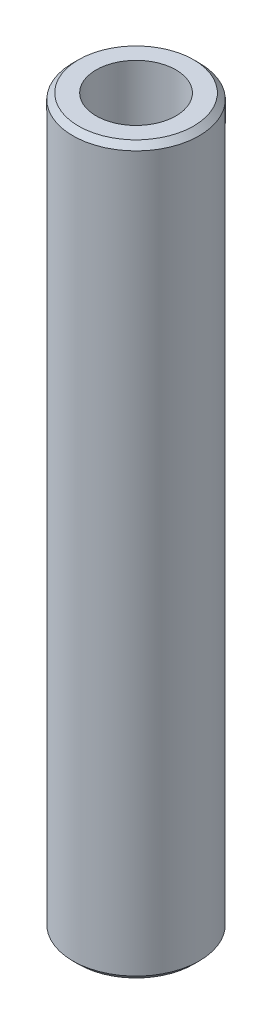
ISO-10303-21;
HEADER;
FILE_DESCRIPTION(('STEP AP214'),'2;1');
FILE_NAME('part.step','',(''),(''),'','','');
FILE_SCHEMA(('AUTOMOTIVE_DESIGN { 1 0 10303 214 1 1 1 1 }'));
ENDSEC;
DATA;
#1=APPLICATION_CONTEXT('core data for automotive mechanical design processes');
#2=APPLICATION_PROTOCOL_DEFINITION('international standard','automotive_design',2000,#1);
#3=PRODUCT_CONTEXT('',#1,'mechanical');
#4=PRODUCT('Part','Part','',(#3));
#5=PRODUCT_RELATED_PRODUCT_CATEGORY('part','',(#4));
#6=PRODUCT_DEFINITION_FORMATION('','',#4);
#7=PRODUCT_DEFINITION_CONTEXT('part definition',#1,'design');
#8=PRODUCT_DEFINITION('design','',#6,#7);
#9=PRODUCT_DEFINITION_SHAPE('','',#8);
#10=(LENGTH_UNIT() NAMED_UNIT(*) SI_UNIT(.MILLI.,.METRE.));
#11=(NAMED_UNIT(*) PLANE_ANGLE_UNIT() SI_UNIT($,.RADIAN.));
#12=(NAMED_UNIT(*) SI_UNIT($,.STERADIAN.) SOLID_ANGLE_UNIT());
#13=UNCERTAINTY_MEASURE_WITH_UNIT(LENGTH_MEASURE(1.E-05),#10,'distance_accuracy_value','');
#14=(GEOMETRIC_REPRESENTATION_CONTEXT(3) GLOBAL_UNCERTAINTY_ASSIGNED_CONTEXT((#13)) GLOBAL_UNIT_ASSIGNED_CONTEXT((#10,
#11,#12)) REPRESENTATION_CONTEXT('',''));
#15=CARTESIAN_POINT('',(0.,0.,0.));
#16=DIRECTION('',(0.,0.,1.));
#17=DIRECTION('',(1.,0.,0.));
#18=AXIS2_PLACEMENT_3D('',#15,#16,#17);
#19=CARTESIAN_POINT('',(0.,114.949775311251,0.));
#20=DIRECTION('',(0.,-1.,0.));
#21=DIRECTION('',(0.,0.,-1.));
#22=AXIS2_PLACEMENT_3D('',#19,#20,#21);
#23=CYLINDRICAL_SURFACE('',#22,10.);
#24=CARTESIAN_POINT('',(0.,114.060758058359,0.));
#25=DIRECTION('',(0.,1.,0.));
#26=DIRECTION('',(0.,0.,1.));
#27=AXIS2_PLACEMENT_3D('',#24,#25,#26);
#28=CIRCLE('',#27,10.);
#29=CARTESIAN_POINT('',(0.,114.060758058359,-10.));
#30=VERTEX_POINT('',#29);
#31=EDGE_CURVE('E50',#30,#30,#28,.F.);
#32=CARTESIAN_POINT('',(0.,0.889017252891852,0.));
#33=DIRECTION('',(0.,1.,0.));
#34=DIRECTION('',(0.,0.,1.));
#35=AXIS2_PLACEMENT_3D('',#32,#33,#34);
#36=CIRCLE('',#35,10.);
#37=CARTESIAN_POINT('',(0.,0.889017252891852,-10.));
#38=VERTEX_POINT('',#37);
#39=EDGE_CURVE('E51',#38,#38,#36,.T.);
#40=CARTESIAN_POINT('',(0.,114.060758058359,-10.));
#41=CARTESIAN_POINT('',(0.,112.881885758302,-10.));
#42=CARTESIAN_POINT('',(0.,111.703013458245,-10.));
#43=CARTESIAN_POINT('',(0.,109.345268858131,-10.));
#44=CARTESIAN_POINT('',(0.,108.166396558074,-10.));
#45=CARTESIAN_POINT('',(0.,105.808651957961,-10.));
#46=CARTESIAN_POINT('',(0.,104.629779657904,-10.));
#47=CARTESIAN_POINT('',(0.,102.27203505779,-10.));
#48=CARTESIAN_POINT('',(0.,101.093162757733,-10.));
#49=CARTESIAN_POINT('',(0.,98.7354181576189,-10.));
#50=CARTESIAN_POINT('',(0.,97.5565458575619,-10.));
#51=CARTESIAN_POINT('',(0.,95.198801257448,-10.));
#52=CARTESIAN_POINT('',(0.,94.0199289573911,-10.));
#53=CARTESIAN_POINT('',(0.,91.6621843572772,-10.));
#54=CARTESIAN_POINT('',(0.,90.4833120572202,-10.));
#55=CARTESIAN_POINT('',(0.,88.1255674571063,-10.));
#56=CARTESIAN_POINT('',(0.,86.9466951570493,-10.));
#57=CARTESIAN_POINT('',(0.,84.5889505569355,-10.));
#58=CARTESIAN_POINT('',(0.,83.4100782568785,-10.));
#59=CARTESIAN_POINT('',(0.,81.0523336567646,-10.));
#60=CARTESIAN_POINT('',(0.,79.8734613567076,-10.));
#61=CARTESIAN_POINT('',(0.,77.5157167565937,-10.));
#62=CARTESIAN_POINT('',(0.,76.3368444565368,-10.));
#63=CARTESIAN_POINT('',(0.,73.9790998564229,-10.));
#64=CARTESIAN_POINT('',(0.,72.8002275563659,-10.));
#65=CARTESIAN_POINT('',(0.,70.442482956252,-10.));
#66=CARTESIAN_POINT('',(0.,69.2636106561951,-10.));
#67=CARTESIAN_POINT('',(0.,66.9058660560812,-10.));
#68=CARTESIAN_POINT('',(0.,65.7269937560242,-10.));
#69=CARTESIAN_POINT('',(0.,63.3692491559103,-10.));
#70=CARTESIAN_POINT('',(0.,62.1903768558534,-10.));
#71=CARTESIAN_POINT('',(0.,59.8326322557395,-10.));
#72=CARTESIAN_POINT('',(0.,58.6537599556825,-10.));
#73=CARTESIAN_POINT('',(0.,56.2960153555686,-10.));
#74=CARTESIAN_POINT('',(0.,55.1171430555117,-10.));
#75=CARTESIAN_POINT('',(0.,52.7593984553978,-10.));
#76=CARTESIAN_POINT('',(0.,51.5805261553408,-10.));
#77=CARTESIAN_POINT('',(0.,49.2227815552269,-10.));
#78=CARTESIAN_POINT('',(0.,48.04390925517,-10.));
#79=CARTESIAN_POINT('',(0.,45.686164655056,-10.));
#80=CARTESIAN_POINT('',(0.,44.5072923549991,-10.));
#81=CARTESIAN_POINT('',(0.,42.1495477548852,-10.));
#82=CARTESIAN_POINT('',(0.,40.9706754548282,-10.));
#83=CARTESIAN_POINT('',(0.,38.6129308547143,-10.));
#84=CARTESIAN_POINT('',(0.,37.4340585546574,-10.));
#85=CARTESIAN_POINT('',(0.,35.0763139545435,-10.));
#86=CARTESIAN_POINT('',(0.,33.8974416544865,-10.));
#87=CARTESIAN_POINT('',(0.,31.5396970543726,-10.));
#88=CARTESIAN_POINT('',(0.,30.3608247543157,-10.));
#89=CARTESIAN_POINT('',(0.,28.0030801542018,-10.));
#90=CARTESIAN_POINT('',(0.,26.8242078541448,-10.));
#91=CARTESIAN_POINT('',(0.,24.4664632540309,-10.));
#92=CARTESIAN_POINT('',(0.,23.287590953974,-10.));
#93=CARTESIAN_POINT('',(0.,20.92984635386,-10.));
#94=CARTESIAN_POINT('',(0.,19.7509740538031,-10.));
#95=CARTESIAN_POINT('',(0.,17.3932294536892,-10.));
#96=CARTESIAN_POINT('',(0.,16.2143571536322,-10.));
#97=CARTESIAN_POINT('',(0.,13.8566125535183,-10.));
#98=CARTESIAN_POINT('',(0.,12.6777402534614,-10.));
#99=CARTESIAN_POINT('',(0.,10.3199956533475,-10.));
#100=CARTESIAN_POINT('',(0.,9.14112335329052,-10.));
#101=CARTESIAN_POINT('',(0.,6.78337875317662,-10.));
#102=CARTESIAN_POINT('',(0.,5.60450645311968,-10.));
#103=CARTESIAN_POINT('',(0.,3.24676185300577,-10.));
#104=CARTESIAN_POINT('',(0.,2.06788955294881,-10.));
#105=CARTESIAN_POINT('',(0.,0.889017252891852,-10.));
#106=B_SPLINE_CURVE_WITH_KNOTS('',3,(#40,#41,#42,#43,#44,#45,#46,#47,#48,#49,#50,#51,#52,#53,
#54,#55,#56,#57,#58,#59,#60,#61,#62,#63,#64,#65,#66,#67,#68,#69,#70,#71,#72,#73,#74,#75,#76,#77,
#78,#79,#80,#81,#82,#83,#84,#85,#86,#87,#88,#89,#90,#91,#92,#93,#94,#95,#96,#97,#98,#99,#100,
#101,#102,#103,#104,#105),.UNSPECIFIED.,.F.,.F.,(4,2,2,2,2,2,2,2,2,2,2,2,2,2,2,2,2,2,2,2,2,2,2,
2,2,2,2,2,2,2,2,2,4),(0.,3.53661690017086,7.07323380034172,10.6098507005126,14.1464676006834,
17.6830845008543,21.2197014010251,24.756318301196,28.2929352013669,31.8295521015377,
35.3661690017086,38.9027859018794,42.4394028020503,45.9760197022211,49.512636602392,
53.0492535025628,56.5858704027337,60.1224873029046,63.6591042030754,67.1957211032463,
70.7323380034171,74.268954903588,77.8055718037588,81.3421887039297,84.8788056041005,
88.4154225042714,91.9520394044423,95.4886563046131,99.025273204784,102.561890104955,
106.098507005126,109.635123905297,113.171740805467),.UNSPECIFIED.);
#107=EDGE_CURVE('BSEAM39',#30,#38,#106,.T.);
#108=ORIENTED_EDGE('',*,*,#31,.T.);
#109=ORIENTED_EDGE('',*,*,#39,.T.);
#110=ORIENTED_EDGE('',*,*,#107,.T.);
#111=ORIENTED_EDGE('',*,*,#107,.F.);
#112=EDGE_LOOP('',(#108,#110,#109,#111));
#113=FACE_BOUND('',#112,.T.);
#114=ADVANCED_FACE('F39',(#113),#23,.T.);
#115=CARTESIAN_POINT('',(0.,114.949775311251,0.));
#116=DIRECTION('',(0.,1.,0.));
#117=DIRECTION('',(0.,0.,1.));
#118=AXIS2_PLACEMENT_3D('',#115,#116,#117);
#119=PLANE('',#118);
#120=CARTESIAN_POINT('',(0.,114.949775311251,0.));
#121=DIRECTION('',(0.,1.,0.));
#122=DIRECTION('',(0.,0.,1.));
#123=AXIS2_PLACEMENT_3D('',#120,#121,#122);
#124=CIRCLE('',#123,9.11098274710827);
#125=CARTESIAN_POINT('',(0.,114.949775311251,9.11098274710827));
#126=VERTEX_POINT('',#125);
#127=EDGE_CURVE('E54',#126,#126,#124,.T.);
#128=ORIENTED_EDGE('',*,*,#127,.T.);
#129=EDGE_LOOP('',(#128));
#130=FACE_BOUND('',#129,.T.);
#131=CARTESIAN_POINT('',(0.,114.949775311251,0.));
#132=DIRECTION('',(0.,1.,0.));
#133=DIRECTION('',(0.,0.,1.));
#134=AXIS2_PLACEMENT_3D('',#131,#132,#133);
#135=CIRCLE('',#134,6.31948241087532);
#136=CARTESIAN_POINT('',(0.,114.949775311251,-6.31948241087532));
#137=VERTEX_POINT('',#136);
#138=EDGE_CURVE('E58',#137,#137,#135,.T.);
#139=ORIENTED_EDGE('',*,*,#138,.F.);
#140=EDGE_LOOP('',(#139));
#141=FACE_BOUND('',#140,.T.);
#142=ADVANCED_FACE('F69',(#130,#141),#119,.T.);
#143=CARTESIAN_POINT('',(0.,0.,0.));
#144=DIRECTION('',(0.,1.,0.));
#145=DIRECTION('',(0.,0.,1.));
#146=AXIS2_PLACEMENT_3D('',#143,#144,#145);
#147=PLANE('',#146);
#148=CARTESIAN_POINT('',(0.,0.,0.));
#149=DIRECTION('',(0.,1.,0.));
#150=DIRECTION('',(0.,0.,1.));
#151=AXIS2_PLACEMENT_3D('',#148,#149,#150);
#152=CIRCLE('',#151,9.11098274710813);
#153=CARTESIAN_POINT('',(0.,0.,9.11098274710813));
#154=VERTEX_POINT('',#153);
#155=EDGE_CURVE('E10',#154,#154,#152,.F.);
#156=ORIENTED_EDGE('',*,*,#155,.T.);
#157=EDGE_LOOP('',(#156));
#158=FACE_BOUND('',#157,.T.);
#159=CARTESIAN_POINT('',(0.,0.,0.));
#160=DIRECTION('',(0.,1.,0.));
#161=DIRECTION('',(0.,0.,1.));
#162=AXIS2_PLACEMENT_3D('',#159,#160,#161);
#163=CIRCLE('',#162,6.31948241087532);
#164=CARTESIAN_POINT('',(0.,0.,-6.31948241087532));
#165=VERTEX_POINT('',#164);
#166=EDGE_CURVE('E63',#165,#165,#163,.T.);
#167=ORIENTED_EDGE('',*,*,#166,.T.);
#168=EDGE_LOOP('',(#167));
#169=FACE_BOUND('',#168,.T.);
#170=ADVANCED_FACE('F75',(#158,#169),#147,.F.);
#171=CARTESIAN_POINT('',(0.,114.949775311251,0.));
#172=DIRECTION('',(0.,-1.,0.));
#173=DIRECTION('',(0.,0.,-1.));
#174=AXIS2_PLACEMENT_3D('',#171,#172,#173);
#175=CYLINDRICAL_SURFACE('',#174,6.31948241087532);
#176=CARTESIAN_POINT('',(0.,114.949775311251,-6.31948241087532));
#177=CARTESIAN_POINT('',(0.,113.752381818425,-6.31948241087532));
#178=CARTESIAN_POINT('',(0.,112.5549883256,-6.31948241087532));
#179=CARTESIAN_POINT('',(0.,110.160201339949,-6.31948241087532));
#180=CARTESIAN_POINT('',(0.,108.962807847123,-6.31948241087532));
#181=CARTESIAN_POINT('',(0.,106.568020861472,-6.31948241087532));
#182=CARTESIAN_POINT('',(0.,105.370627368647,-6.31948241087532));
#183=CARTESIAN_POINT('',(0.,102.975840382996,-6.31948241087532));
#184=CARTESIAN_POINT('',(0.,101.77844689017,-6.31948241087532));
#185=CARTESIAN_POINT('',(0.,99.3836599045191,-6.31948241087532));
#186=CARTESIAN_POINT('',(0.,98.1862664116936,-6.31948241087532));
#187=CARTESIAN_POINT('',(0.,95.7914794260425,-6.31948241087532));
#188=CARTESIAN_POINT('',(0.,94.594085933217,-6.31948241087532));
#189=CARTESIAN_POINT('',(0.,92.1992989475659,-6.31948241087532));
#190=CARTESIAN_POINT('',(0.,91.0019054547404,-6.31948241087532));
#191=CARTESIAN_POINT('',(0.,88.6071184690893,-6.31948241087532));
#192=CARTESIAN_POINT('',(0.,87.4097249762638,-6.31948241087532));
#193=CARTESIAN_POINT('',(0.,85.0149379906127,-6.31948241087532));
#194=CARTESIAN_POINT('',(0.,83.8175444977872,-6.31948241087532));
#195=CARTESIAN_POINT('',(0.,81.4227575121361,-6.31948241087532));
#196=CARTESIAN_POINT('',(0.,80.2253640193106,-6.31948241087532));
#197=CARTESIAN_POINT('',(0.,77.8305770336595,-6.31948241087532));
#198=CARTESIAN_POINT('',(0.,76.633183540834,-6.31948241087532));
#199=CARTESIAN_POINT('',(0.,74.2383965551829,-6.31948241087532));
#200=CARTESIAN_POINT('',(0.,73.0410030623574,-6.31948241087532));
#201=CARTESIAN_POINT('',(0.,70.6462160767063,-6.31948241087532));
#202=CARTESIAN_POINT('',(0.,69.4488225838808,-6.31948241087532));
#203=CARTESIAN_POINT('',(0.,67.0540355982297,-6.31948241087532));
#204=CARTESIAN_POINT('',(0.,65.8566421054042,-6.31948241087532));
#205=CARTESIAN_POINT('',(0.,63.4618551197531,-6.31948241087532));
#206=CARTESIAN_POINT('',(0.,62.2644616269276,-6.31948241087532));
#207=CARTESIAN_POINT('',(0.,59.8696746412766,-6.31948241087532));
#208=CARTESIAN_POINT('',(0.,58.672281148451,-6.31948241087532));
#209=CARTESIAN_POINT('',(0.,56.2774941628,-6.31948241087532));
#210=CARTESIAN_POINT('',(0.,55.0801006699744,-6.31948241087532));
#211=CARTESIAN_POINT('',(0.,52.6853136843234,-6.31948241087532));
#212=CARTESIAN_POINT('',(0.,51.4879201914978,-6.31948241087532));
#213=CARTESIAN_POINT('',(0.,49.0931332058468,-6.31948241087532));
#214=CARTESIAN_POINT('',(0.,47.8957397130212,-6.31948241087532));
#215=CARTESIAN_POINT('',(0.,45.5009527273702,-6.31948241087532));
#216=CARTESIAN_POINT('',(0.,44.3035592345447,-6.31948241087532));
#217=CARTESIAN_POINT('',(0.,41.9087722488936,-6.31948241087532));
#218=CARTESIAN_POINT('',(0.,40.7113787560681,-6.31948241087532));
#219=CARTESIAN_POINT('',(0.,38.316591770417,-6.31948241087532));
#220=CARTESIAN_POINT('',(0.,37.1191982775915,-6.31948241087532));
#221=CARTESIAN_POINT('',(0.,34.7244112919404,-6.31948241087532));
#222=CARTESIAN_POINT('',(0.,33.5270177991149,-6.31948241087532));
#223=CARTESIAN_POINT('',(0.,31.1322308134638,-6.31948241087532));
#224=CARTESIAN_POINT('',(0.,29.9348373206383,-6.31948241087532));
#225=CARTESIAN_POINT('',(0.,27.5400503349872,-6.31948241087532));
#226=CARTESIAN_POINT('',(0.,26.3426568421617,-6.31948241087532));
#227=CARTESIAN_POINT('',(0.,23.9478698565106,-6.31948241087532));
#228=CARTESIAN_POINT('',(0.,22.7504763636851,-6.31948241087532));
#229=CARTESIAN_POINT('',(0.,20.355689378034,-6.31948241087532));
#230=CARTESIAN_POINT('',(0.,19.1582958852085,-6.31948241087532));
#231=CARTESIAN_POINT('',(0.,16.7635088995574,-6.31948241087532));
#232=CARTESIAN_POINT('',(0.,15.5661154067319,-6.31948241087532));
#233=CARTESIAN_POINT('',(0.,13.1713284210808,-6.31948241087532));
#234=CARTESIAN_POINT('',(0.,11.9739349282553,-6.31948241087532));
#235=CARTESIAN_POINT('',(0.,9.57914794260423,-6.31948241087532));
#236=CARTESIAN_POINT('',(0.,8.3817544497787,-6.31948241087532));
#237=CARTESIAN_POINT('',(0.,5.98696746412764,-6.31948241087532));
#238=CARTESIAN_POINT('',(0.,4.78957397130211,-6.31948241087532));
#239=CARTESIAN_POINT('',(0.,2.39478698565105,-6.31948241087532));
#240=CARTESIAN_POINT('',(0.,1.19739349282552,-6.31948241087532));
#241=CARTESIAN_POINT('',(0.,0.,-6.31948241087532));
#242=B_SPLINE_CURVE_WITH_KNOTS('',3,(#176,#177,#178,#179,#180,#181,#182,#183,#184,#185,#186,
#187,#188,#189,#190,#191,#192,#193,#194,#195,#196,#197,#198,#199,#200,#201,#202,#203,#204,#205,
#206,#207,#208,#209,#210,#211,#212,#213,#214,#215,#216,#217,#218,#219,#220,#221,#222,#223,#224,
#225,#226,#227,#228,#229,#230,#231,#232,#233,#234,#235,#236,#237,#238,#239,#240,#241),
.UNSPECIFIED.,.F.,.F.,(4,2,2,2,2,2,2,2,2,2,2,2,2,2,2,2,2,2,2,2,2,2,2,2,2,2,2,2,2,2,2,2,4),(0.,
3.59218047847659,7.18436095695318,10.7765414354298,14.3687219139064,17.960902392383,
21.5530828708596,25.1452633493361,28.7374438278128,32.3296243062893,35.9218047847659,
39.5139852632425,43.1061657417191,46.6983462201957,50.2905266986723,53.8827071771489,
57.4748876556255,61.0670681341021,64.6592486125787,68.2514290910553,71.8436095695319,
75.4357900480085,79.027970526485,82.6201510049617,86.2123314834382,89.8045119619148,
93.3966924403914,96.988872918868,100.581053397345,104.173233875821,107.765414354298,
111.357594832774,114.949775311251),.UNSPECIFIED.);
#243=EDGE_CURVE('BSEAM70',#137,#165,#242,.T.);
#244=ORIENTED_EDGE('',*,*,#138,.T.);
#245=ORIENTED_EDGE('',*,*,#166,.F.);
#246=ORIENTED_EDGE('',*,*,#243,.T.);
#247=ORIENTED_EDGE('',*,*,#243,.F.);
#248=EDGE_LOOP('',(#244,#246,#245,#247));
#249=FACE_BOUND('',#248,.T.);
#250=ADVANCED_FACE('F70',(#249),#175,.F.);
#251=CARTESIAN_POINT('',(0.,114.949775311251,0.));
#252=DIRECTION('',(0.,-1.,0.));
#253=DIRECTION('',(0.,0.,-1.));
#254=AXIS2_PLACEMENT_3D('',#251,#252,#253);
#255=CONICAL_SURFACE('',#254,9.11098274710827,0.785398163397445);
#256=ORIENTED_EDGE('',*,*,#31,.F.);
#257=EDGE_LOOP('',(#256));
#258=FACE_BOUND('',#257,.T.);
#259=ORIENTED_EDGE('',*,*,#127,.F.);
#260=EDGE_LOOP('',(#259));
#261=FACE_BOUND('',#260,.T.);
#262=ADVANCED_FACE('F81',(#258,#261),#255,.T.);
#263=CARTESIAN_POINT('',(0.,0.889017252891852,0.));
#264=DIRECTION('',(0.,1.,0.));
#265=DIRECTION('',(0.,0.,1.));
#266=AXIS2_PLACEMENT_3D('',#263,#264,#265);
#267=CONICAL_SURFACE('',#266,10.,0.78539816339746);
#268=ORIENTED_EDGE('',*,*,#155,.F.);
#269=EDGE_LOOP('',(#268));
#270=FACE_BOUND('',#269,.T.);
#271=ORIENTED_EDGE('',*,*,#39,.F.);
#272=EDGE_LOOP('',(#271));
#273=FACE_BOUND('',#272,.T.);
#274=ADVANCED_FACE('F45',(#270,#273),#267,.T.);
#275=CLOSED_SHELL('',(#114,#142,#170,#250,#262,#274));
#276=MANIFOLD_SOLID_BREP('B2',#275);
#277=ADVANCED_BREP_SHAPE_REPRESENTATION('',(#18,#276),#14);
#278=SHAPE_DEFINITION_REPRESENTATION(#9,#277);
ENDSEC;
END-ISO-10303-21;
